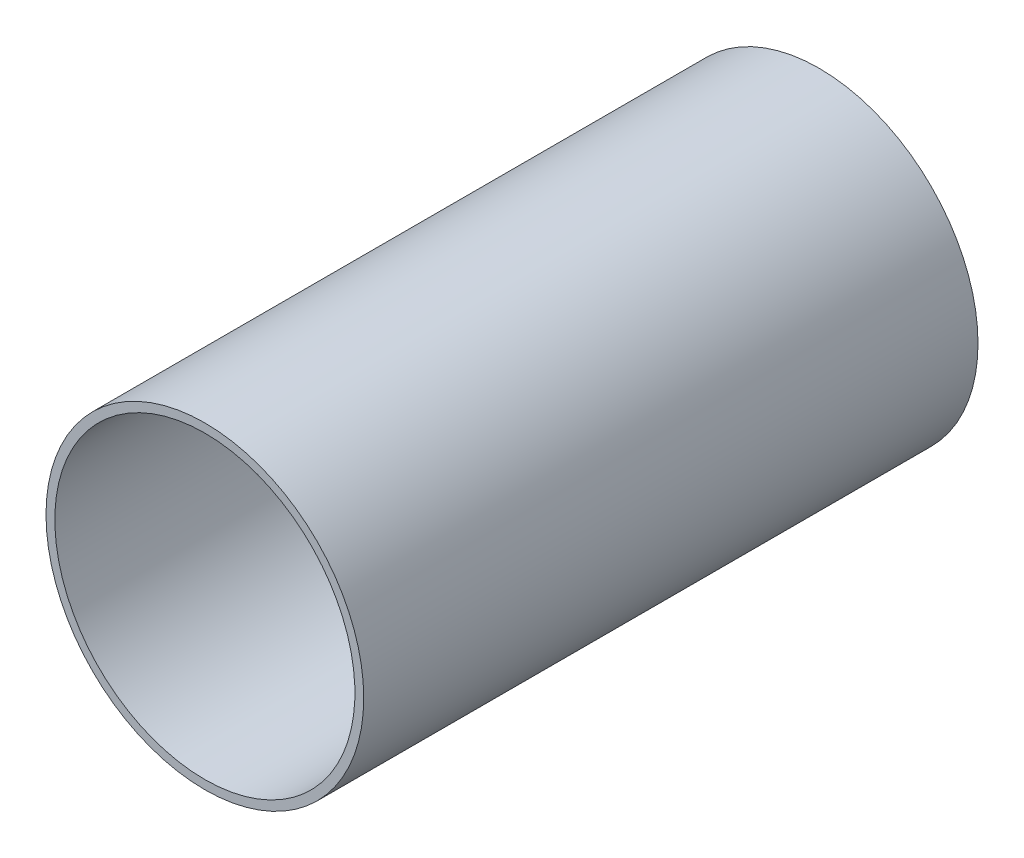
ISO-10303-21;
HEADER;
FILE_DESCRIPTION(('STEP AP214'),'2;1');
FILE_NAME('part.step','',(''),(''),'','','');
FILE_SCHEMA(('AUTOMOTIVE_DESIGN { 1 0 10303 214 1 1 1 1 }'));
ENDSEC;
DATA;
#1=APPLICATION_CONTEXT('core data for automotive mechanical design processes');
#2=APPLICATION_PROTOCOL_DEFINITION('international standard','automotive_design',2000,#1);
#3=PRODUCT_CONTEXT('',#1,'mechanical');
#4=PRODUCT('Part','Part','',(#3));
#5=PRODUCT_RELATED_PRODUCT_CATEGORY('part','',(#4));
#6=PRODUCT_DEFINITION_FORMATION('','',#4);
#7=PRODUCT_DEFINITION_CONTEXT('part definition',#1,'design');
#8=PRODUCT_DEFINITION('design','',#6,#7);
#9=PRODUCT_DEFINITION_SHAPE('','',#8);
#10=(LENGTH_UNIT() NAMED_UNIT(*) SI_UNIT(.MILLI.,.METRE.));
#11=(NAMED_UNIT(*) PLANE_ANGLE_UNIT() SI_UNIT($,.RADIAN.));
#12=(NAMED_UNIT(*) SI_UNIT($,.STERADIAN.) SOLID_ANGLE_UNIT());
#13=UNCERTAINTY_MEASURE_WITH_UNIT(LENGTH_MEASURE(1.E-05),#10,'distance_accuracy_value','');
#14=(GEOMETRIC_REPRESENTATION_CONTEXT(3) GLOBAL_UNCERTAINTY_ASSIGNED_CONTEXT((#13)) GLOBAL_UNIT_ASSIGNED_CONTEXT((#10,
#11,#12)) REPRESENTATION_CONTEXT('',''));
#15=CARTESIAN_POINT('',(0.,0.,0.));
#16=DIRECTION('',(0.,0.,1.));
#17=DIRECTION('',(1.,0.,0.));
#18=AXIS2_PLACEMENT_3D('',#15,#16,#17);
#19=CARTESIAN_POINT('',(117.1498,-71.2108,-0.045));
#20=DIRECTION('',(0.,0.,-1.));
#21=DIRECTION('',(0.,-1.,0.));
#22=AXIS2_PLACEMENT_3D('',#19,#20,#21);
#23=CYLINDRICAL_SURFACE('',#22,0.425);
#24=CARTESIAN_POINT('',(117.1498,-71.2108,-0.035));
#25=DIRECTION('',(0.,0.,-1.));
#26=DIRECTION('',(0.,-1.,0.));
#27=AXIS2_PLACEMENT_3D('',#24,#25,#26);
#28=CIRCLE('',#27,0.425);
#29=CARTESIAN_POINT('',(117.1498,-71.6358,-0.035));
#30=VERTEX_POINT('',#29);
#31=EDGE_CURVE('E64',#30,#30,#28,.T.);
#32=ORIENTED_EDGE('',*,*,#31,.T.);
#33=DIRECTION('',(0.,0.,1.));
#34=VECTOR('',#33,1.);
#35=CARTESIAN_POINT('',(117.1498,-71.6358,-0.045));
#36=LINE('',#35,#34);
#37=CARTESIAN_POINT('',(117.1498,-71.6358,1.705));
#38=VERTEX_POINT('',#37);
#39=EDGE_CURVE('E11',#30,#38,#36,.T.);
#40=ORIENTED_EDGE('',*,*,#39,.T.);
#41=CARTESIAN_POINT('',(117.1498,-71.2108,1.705));
#42=DIRECTION('',(0.,0.,-1.));
#43=DIRECTION('',(0.,-1.,0.));
#44=AXIS2_PLACEMENT_3D('',#41,#42,#43);
#45=CIRCLE('',#44,0.425);
#46=EDGE_CURVE('E21',#38,#38,#45,.T.);
#47=ORIENTED_EDGE('',*,*,#46,.F.);
#48=ORIENTED_EDGE('',*,*,#39,.F.);
#49=EDGE_LOOP('',(#32,#40,#47,#48));
#50=FACE_BOUND('',#49,.T.);
#51=ADVANCED_FACE('F17',(#50),#23,.F.);
#52=CARTESIAN_POINT('',(117.1498,-71.6608,1.705));
#53=DIRECTION('',(0.,0.,1.));
#54=DIRECTION('',(1.,0.,0.));
#55=AXIS2_PLACEMENT_3D('',#52,#53,#54);
#56=PLANE('',#55);
#57=ORIENTED_EDGE('',*,*,#46,.T.);
#58=EDGE_LOOP('',(#57));
#59=FACE_BOUND('',#58,.T.);
#60=CARTESIAN_POINT('',(117.1498,-71.2108,1.705));
#61=DIRECTION('',(0.,0.,1.));
#62=DIRECTION('',(0.,-1.,0.));
#63=AXIS2_PLACEMENT_3D('',#60,#61,#62);
#64=CIRCLE('',#63,0.45);
#65=CARTESIAN_POINT('',(117.1498,-71.6608,1.705));
#66=VERTEX_POINT('',#65);
#67=EDGE_CURVE('E56',#66,#66,#64,.T.);
#68=ORIENTED_EDGE('',*,*,#67,.T.);
#69=EDGE_LOOP('',(#68));
#70=FACE_BOUND('',#69,.T.);
#71=ADVANCED_FACE('F19',(#59,#70),#56,.T.);
#72=CARTESIAN_POINT('',(117.1498,-71.6608,-0.035));
#73=DIRECTION('',(0.,0.,1.));
#74=DIRECTION('',(1.,0.,0.));
#75=AXIS2_PLACEMENT_3D('',#72,#73,#74);
#76=PLANE('',#75);
#77=ORIENTED_EDGE('',*,*,#31,.F.);
#78=EDGE_LOOP('',(#77));
#79=FACE_BOUND('',#78,.T.);
#80=CARTESIAN_POINT('',(117.1498,-71.2108,-0.035));
#81=DIRECTION('',(0.,0.,1.));
#82=DIRECTION('',(0.,-1.,0.));
#83=AXIS2_PLACEMENT_3D('',#80,#81,#82);
#84=CIRCLE('',#83,0.45);
#85=CARTESIAN_POINT('',(117.1498,-71.6608,-0.035));
#86=VERTEX_POINT('',#85);
#87=EDGE_CURVE('E55',#86,#86,#84,.T.);
#88=ORIENTED_EDGE('',*,*,#87,.F.);
#89=EDGE_LOOP('',(#88));
#90=FACE_BOUND('',#89,.T.);
#91=ADVANCED_FACE('F83',(#79,#90),#76,.F.);
#92=CARTESIAN_POINT('',(117.1498,-71.2108,-0.035));
#93=DIRECTION('',(0.,0.,-1.));
#94=DIRECTION('',(0.,-1.,0.));
#95=AXIS2_PLACEMENT_3D('',#92,#93,#94);
#96=CYLINDRICAL_SURFACE('',#95,0.45);
#97=ORIENTED_EDGE('',*,*,#87,.T.);
#98=DIRECTION('',(0.,0.,1.));
#99=VECTOR('',#98,1.);
#100=CARTESIAN_POINT('',(117.1498,-71.6608,-0.035));
#101=LINE('',#100,#99);
#102=EDGE_CURVE('E52',#86,#66,#101,.T.);
#103=ORIENTED_EDGE('',*,*,#102,.T.);
#104=ORIENTED_EDGE('',*,*,#67,.F.);
#105=ORIENTED_EDGE('',*,*,#102,.F.);
#106=EDGE_LOOP('',(#97,#103,#104,#105));
#107=FACE_BOUND('',#106,.T.);
#108=ADVANCED_FACE('F53',(#107),#96,.T.);
#109=CLOSED_SHELL('',(#51,#71,#91,#108));
#110=MANIFOLD_SOLID_BREP('B1',#109);
#111=ADVANCED_BREP_SHAPE_REPRESENTATION('',(#18,#110),#14);
#112=SHAPE_DEFINITION_REPRESENTATION(#9,#111);
ENDSEC;
END-ISO-10303-21;
